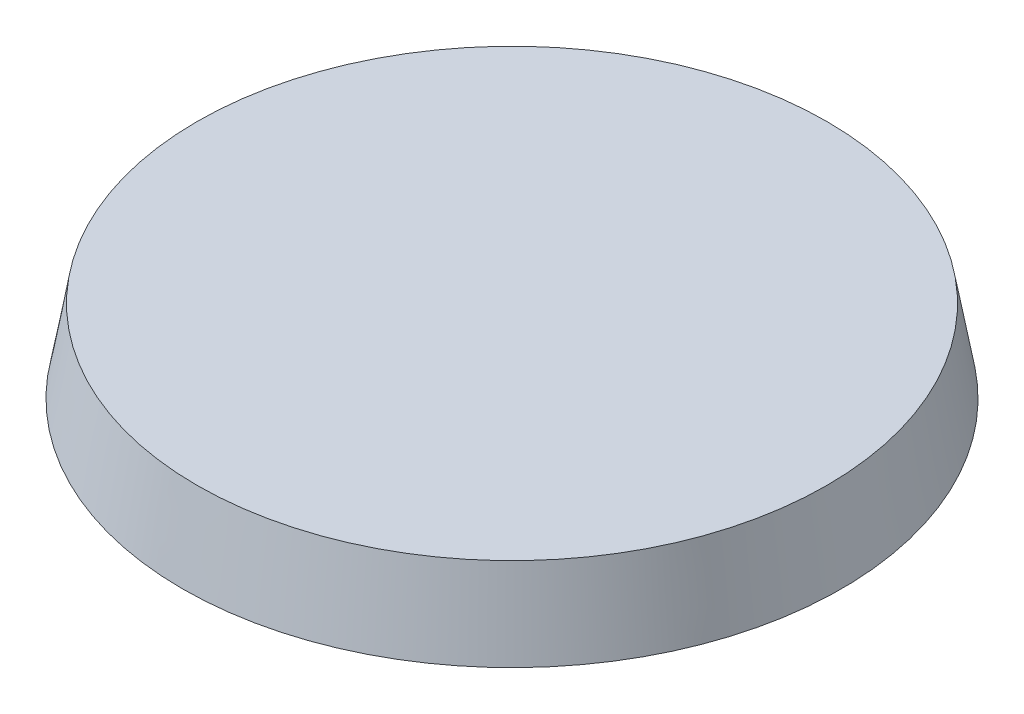
ISO-10303-21;
HEADER;
FILE_DESCRIPTION(('STEP AP214'),'2;1');
FILE_NAME('part.step','',(''),(''),'','','');
FILE_SCHEMA(('AUTOMOTIVE_DESIGN { 1 0 10303 214 1 1 1 1 }'));
ENDSEC;
DATA;
#1=APPLICATION_CONTEXT('core data for automotive mechanical design processes');
#2=APPLICATION_PROTOCOL_DEFINITION('international standard','automotive_design',2000,#1);
#3=PRODUCT_CONTEXT('',#1,'mechanical');
#4=PRODUCT('Part','Part','',(#3));
#5=PRODUCT_RELATED_PRODUCT_CATEGORY('part','',(#4));
#6=PRODUCT_DEFINITION_FORMATION('','',#4);
#7=PRODUCT_DEFINITION_CONTEXT('part definition',#1,'design');
#8=PRODUCT_DEFINITION('design','',#6,#7);
#9=PRODUCT_DEFINITION_SHAPE('','',#8);
#10=(LENGTH_UNIT() NAMED_UNIT(*) SI_UNIT(.MILLI.,.METRE.));
#11=(NAMED_UNIT(*) PLANE_ANGLE_UNIT() SI_UNIT($,.RADIAN.));
#12=(NAMED_UNIT(*) SI_UNIT($,.STERADIAN.) SOLID_ANGLE_UNIT());
#13=UNCERTAINTY_MEASURE_WITH_UNIT(LENGTH_MEASURE(1.E-05),#10,'distance_accuracy_value','');
#14=(GEOMETRIC_REPRESENTATION_CONTEXT(3) GLOBAL_UNCERTAINTY_ASSIGNED_CONTEXT((#13)) GLOBAL_UNIT_ASSIGNED_CONTEXT((#10,
#11,#12)) REPRESENTATION_CONTEXT('',''));
#15=CARTESIAN_POINT('',(0.,0.,0.));
#16=DIRECTION('',(0.,0.,1.));
#17=DIRECTION('',(1.,0.,0.));
#18=AXIS2_PLACEMENT_3D('',#15,#16,#17);
#19=CARTESIAN_POINT('',(0.,0.,0.));
#20=DIRECTION('',(0.,-1.,0.));
#21=DIRECTION('',(0.,0.,1.));
#22=AXIS2_PLACEMENT_3D('',#19,#20,#21);
#23=CONICAL_SURFACE('',#22,14.,0.174532925199433);
#24=CARTESIAN_POINT('',(0.,3.5,0.));
#25=DIRECTION('',(0.,1.,0.));
#26=DIRECTION('',(0.,0.,1.));
#27=AXIS2_PLACEMENT_3D('',#24,#25,#26);
#28=CIRCLE('',#27,13.3828555675204);
#29=CARTESIAN_POINT('',(0.,3.5,13.3828555675204));
#30=VERTEX_POINT('',#29);
#31=EDGE_CURVE('E10',#30,#30,#28,.T.);
#32=ORIENTED_EDGE('',*,*,#31,.F.);
#33=EDGE_LOOP('',(#32));
#34=FACE_BOUND('',#33,.T.);
#35=CARTESIAN_POINT('',(0.,0.,0.));
#36=DIRECTION('',(0.,1.,0.));
#37=DIRECTION('',(0.,0.,1.));
#38=AXIS2_PLACEMENT_3D('',#35,#36,#37);
#39=CIRCLE('',#38,14.);
#40=CARTESIAN_POINT('',(0.,0.,14.));
#41=VERTEX_POINT('',#40);
#42=EDGE_CURVE('E39',#41,#41,#39,.T.);
#43=ORIENTED_EDGE('',*,*,#42,.T.);
#44=EDGE_LOOP('',(#43));
#45=FACE_BOUND('',#44,.T.);
#46=ADVANCED_FACE('F33',(#34,#45),#23,.T.);
#47=CARTESIAN_POINT('',(0.,3.5,0.));
#48=DIRECTION('',(0.,1.,0.));
#49=DIRECTION('',(0.,0.,1.));
#50=AXIS2_PLACEMENT_3D('',#47,#48,#49);
#51=PLANE('',#50);
#52=ORIENTED_EDGE('',*,*,#31,.T.);
#53=EDGE_LOOP('',(#52));
#54=FACE_BOUND('',#53,.T.);
#55=ADVANCED_FACE('F48',(#54),#51,.T.);
#56=CARTESIAN_POINT('',(0.,0.,0.));
#57=DIRECTION('',(0.,1.,0.));
#58=DIRECTION('',(0.,0.,1.));
#59=AXIS2_PLACEMENT_3D('',#56,#57,#58);
#60=PLANE('',#59);
#61=ORIENTED_EDGE('',*,*,#42,.F.);
#62=EDGE_LOOP('',(#61));
#63=FACE_BOUND('',#62,.T.);
#64=ADVANCED_FACE('F46',(#63),#60,.F.);
#65=CLOSED_SHELL('',(#46,#55,#64));
#66=MANIFOLD_SOLID_BREP('B2',#65);
#67=ADVANCED_BREP_SHAPE_REPRESENTATION('',(#18,#66),#14);
#68=SHAPE_DEFINITION_REPRESENTATION(#9,#67);
ENDSEC;
END-ISO-10303-21;
